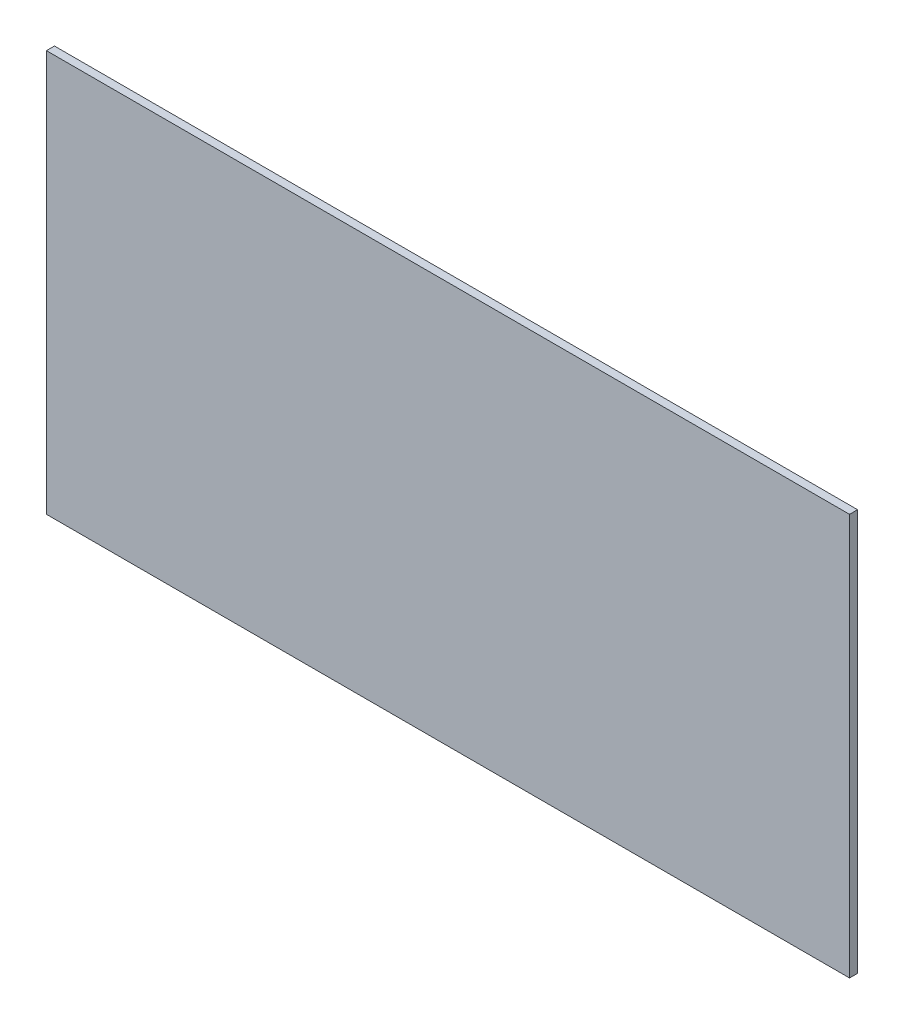
ISO-10303-21;
HEADER;
FILE_DESCRIPTION(('STEP AP214'),'2;1');
FILE_NAME('part.step','',(''),(''),'','','');
FILE_SCHEMA(('AUTOMOTIVE_DESIGN { 1 0 10303 214 1 1 1 1 }'));
ENDSEC;
DATA;
#1=APPLICATION_CONTEXT('core data for automotive mechanical design processes');
#2=APPLICATION_PROTOCOL_DEFINITION('international standard','automotive_design',2000,#1);
#3=PRODUCT_CONTEXT('',#1,'mechanical');
#4=PRODUCT('Part','Part','',(#3));
#5=PRODUCT_RELATED_PRODUCT_CATEGORY('part','',(#4));
#6=PRODUCT_DEFINITION_FORMATION('','',#4);
#7=PRODUCT_DEFINITION_CONTEXT('part definition',#1,'design');
#8=PRODUCT_DEFINITION('design','',#6,#7);
#9=PRODUCT_DEFINITION_SHAPE('','',#8);
#10=(LENGTH_UNIT() NAMED_UNIT(*) SI_UNIT(.MILLI.,.METRE.));
#11=(NAMED_UNIT(*) PLANE_ANGLE_UNIT() SI_UNIT($,.RADIAN.));
#12=(NAMED_UNIT(*) SI_UNIT($,.STERADIAN.) SOLID_ANGLE_UNIT());
#13=UNCERTAINTY_MEASURE_WITH_UNIT(LENGTH_MEASURE(1.E-05),#10,'distance_accuracy_value','');
#14=(GEOMETRIC_REPRESENTATION_CONTEXT(3) GLOBAL_UNCERTAINTY_ASSIGNED_CONTEXT((#13)) GLOBAL_UNIT_ASSIGNED_CONTEXT((#10,
#11,#12)) REPRESENTATION_CONTEXT('',''));
#15=CARTESIAN_POINT('',(0.,0.,0.));
#16=DIRECTION('',(0.,0.,1.));
#17=DIRECTION('',(1.,0.,0.));
#18=AXIS2_PLACEMENT_3D('',#15,#16,#17);
#19=CARTESIAN_POINT('',(400.,200.,4.));
#20=DIRECTION('',(-1.,0.,0.));
#21=DIRECTION('',(0.,0.,1.));
#22=AXIS2_PLACEMENT_3D('',#19,#20,#21);
#23=PLANE('',#22);
#24=DIRECTION('',(0.,1.,0.));
#25=VECTOR('',#24,1.);
#26=CARTESIAN_POINT('',(400.,200.,0.));
#27=LINE('',#26,#25);
#28=CARTESIAN_POINT('',(400.,0.,0.));
#29=VERTEX_POINT('',#28);
#30=CARTESIAN_POINT('',(400.,200.,0.));
#31=VERTEX_POINT('',#30);
#32=EDGE_CURVE('E99',#29,#31,#27,.T.);
#33=ORIENTED_EDGE('',*,*,#32,.T.);
#34=DIRECTION('',(0.,0.,-1.));
#35=VECTOR('',#34,1.);
#36=CARTESIAN_POINT('',(400.,200.,4.));
#37=LINE('',#36,#35);
#38=CARTESIAN_POINT('',(400.,200.,4.));
#39=VERTEX_POINT('',#38);
#40=EDGE_CURVE('E11',#39,#31,#37,.T.);
#41=ORIENTED_EDGE('',*,*,#40,.F.);
#42=DIRECTION('',(0.,1.,0.));
#43=VECTOR('',#42,1.);
#44=CARTESIAN_POINT('',(400.,200.,4.));
#45=LINE('',#44,#43);
#46=CARTESIAN_POINT('',(400.,0.,4.));
#47=VERTEX_POINT('',#46);
#48=EDGE_CURVE('E87',#47,#39,#45,.T.);
#49=ORIENTED_EDGE('',*,*,#48,.F.);
#50=DIRECTION('',(0.,0.,-1.));
#51=VECTOR('',#50,1.);
#52=CARTESIAN_POINT('',(400.,0.,4.));
#53=LINE('',#52,#51);
#54=EDGE_CURVE('E95',#47,#29,#53,.T.);
#55=ORIENTED_EDGE('',*,*,#54,.T.);
#56=EDGE_LOOP('',(#33,#41,#49,#55));
#57=FACE_BOUND('',#56,.T.);
#58=ADVANCED_FACE('F36',(#57),#23,.F.);
#59=CARTESIAN_POINT('',(400.,200.,4.));
#60=DIRECTION('',(0.,-1.,0.));
#61=DIRECTION('',(1.,0.,0.));
#62=AXIS2_PLACEMENT_3D('',#59,#60,#61);
#63=PLANE('',#62);
#64=DIRECTION('',(-1.,0.,0.));
#65=VECTOR('',#64,1.);
#66=CARTESIAN_POINT('',(400.,200.,0.));
#67=LINE('',#66,#65);
#68=CARTESIAN_POINT('',(0.,200.,0.));
#69=VERTEX_POINT('',#68);
#70=EDGE_CURVE('E91',#31,#69,#67,.T.);
#71=ORIENTED_EDGE('',*,*,#70,.T.);
#72=DIRECTION('',(0.,0.,-1.));
#73=VECTOR('',#72,1.);
#74=CARTESIAN_POINT('',(0.,200.,4.));
#75=LINE('',#74,#73);
#76=CARTESIAN_POINT('',(0.,200.,4.));
#77=VERTEX_POINT('',#76);
#78=EDGE_CURVE('E44',#77,#69,#75,.T.);
#79=ORIENTED_EDGE('',*,*,#78,.F.);
#80=DIRECTION('',(-1.,0.,0.));
#81=VECTOR('',#80,1.);
#82=CARTESIAN_POINT('',(400.,200.,4.));
#83=LINE('',#82,#81);
#84=EDGE_CURVE('E82',#39,#77,#83,.T.);
#85=ORIENTED_EDGE('',*,*,#84,.F.);
#86=ORIENTED_EDGE('',*,*,#40,.T.);
#87=EDGE_LOOP('',(#71,#79,#85,#86));
#88=FACE_BOUND('',#87,.T.);
#89=ADVANCED_FACE('F90',(#88),#63,.F.);
#90=CARTESIAN_POINT('',(0.,200.,4.));
#91=DIRECTION('',(1.,0.,0.));
#92=DIRECTION('',(0.,1.,0.));
#93=AXIS2_PLACEMENT_3D('',#90,#91,#92);
#94=PLANE('',#93);
#95=DIRECTION('',(0.,-1.,0.));
#96=VECTOR('',#95,1.);
#97=CARTESIAN_POINT('',(0.,200.,0.));
#98=LINE('',#97,#96);
#99=CARTESIAN_POINT('',(0.,0.,0.));
#100=VERTEX_POINT('',#99);
#101=EDGE_CURVE('E69',#69,#100,#98,.T.);
#102=ORIENTED_EDGE('',*,*,#101,.T.);
#103=DIRECTION('',(0.,0.,-1.));
#104=VECTOR('',#103,1.);
#105=CARTESIAN_POINT('',(0.,0.,4.));
#106=LINE('',#105,#104);
#107=CARTESIAN_POINT('',(0.,0.,4.));
#108=VERTEX_POINT('',#107);
#109=EDGE_CURVE('E92',#108,#100,#106,.T.);
#110=ORIENTED_EDGE('',*,*,#109,.F.);
#111=DIRECTION('',(0.,-1.,0.));
#112=VECTOR('',#111,1.);
#113=CARTESIAN_POINT('',(0.,200.,4.));
#114=LINE('',#113,#112);
#115=EDGE_CURVE('E85',#77,#108,#114,.T.);
#116=ORIENTED_EDGE('',*,*,#115,.F.);
#117=ORIENTED_EDGE('',*,*,#78,.T.);
#118=EDGE_LOOP('',(#102,#110,#116,#117));
#119=FACE_BOUND('',#118,.T.);
#120=ADVANCED_FACE('F93',(#119),#94,.F.);
#121=CARTESIAN_POINT('',(400.,0.,4.));
#122=DIRECTION('',(0.,1.,0.));
#123=DIRECTION('',(-1.,0.,0.));
#124=AXIS2_PLACEMENT_3D('',#121,#122,#123);
#125=PLANE('',#124);
#126=DIRECTION('',(1.,0.,0.));
#127=VECTOR('',#126,1.);
#128=CARTESIAN_POINT('',(400.,0.,0.));
#129=LINE('',#128,#127);
#130=EDGE_CURVE('E75',#100,#29,#129,.T.);
#131=ORIENTED_EDGE('',*,*,#130,.T.);
#132=ORIENTED_EDGE('',*,*,#54,.F.);
#133=DIRECTION('',(1.,0.,0.));
#134=VECTOR('',#133,1.);
#135=CARTESIAN_POINT('',(400.,0.,4.));
#136=LINE('',#135,#134);
#137=EDGE_CURVE('E52',#108,#47,#136,.T.);
#138=ORIENTED_EDGE('',*,*,#137,.F.);
#139=ORIENTED_EDGE('',*,*,#109,.T.);
#140=EDGE_LOOP('',(#131,#132,#138,#139));
#141=FACE_BOUND('',#140,.T.);
#142=ADVANCED_FACE('F106',(#141),#125,.F.);
#143=CARTESIAN_POINT('',(0.,0.,4.));
#144=DIRECTION('',(0.,0.,-1.));
#145=DIRECTION('',(-1.,0.,0.));
#146=AXIS2_PLACEMENT_3D('',#143,#144,#145);
#147=PLANE('',#146);
#148=ORIENTED_EDGE('',*,*,#48,.T.);
#149=ORIENTED_EDGE('',*,*,#84,.T.);
#150=ORIENTED_EDGE('',*,*,#115,.T.);
#151=ORIENTED_EDGE('',*,*,#137,.T.);
#152=EDGE_LOOP('',(#148,#149,#150,#151));
#153=FACE_BOUND('',#152,.T.);
#154=ADVANCED_FACE('F83',(#153),#147,.F.);
#155=CARTESIAN_POINT('',(0.,0.,0.));
#156=DIRECTION('',(0.,0.,-1.));
#157=DIRECTION('',(-1.,0.,0.));
#158=AXIS2_PLACEMENT_3D('',#155,#156,#157);
#159=PLANE('',#158);
#160=ORIENTED_EDGE('',*,*,#32,.F.);
#161=ORIENTED_EDGE('',*,*,#130,.F.);
#162=ORIENTED_EDGE('',*,*,#101,.F.);
#163=ORIENTED_EDGE('',*,*,#70,.F.);
#164=EDGE_LOOP('',(#160,#161,#162,#163));
#165=FACE_BOUND('',#164,.T.);
#166=ADVANCED_FACE('F109',(#165),#159,.T.);
#167=CLOSED_SHELL('',(#58,#89,#120,#142,#154,#166));
#168=MANIFOLD_SOLID_BREP('B2',#167);
#169=ADVANCED_BREP_SHAPE_REPRESENTATION('',(#18,#168),#14);
#170=SHAPE_DEFINITION_REPRESENTATION(#9,#169);
ENDSEC;
END-ISO-10303-21;
